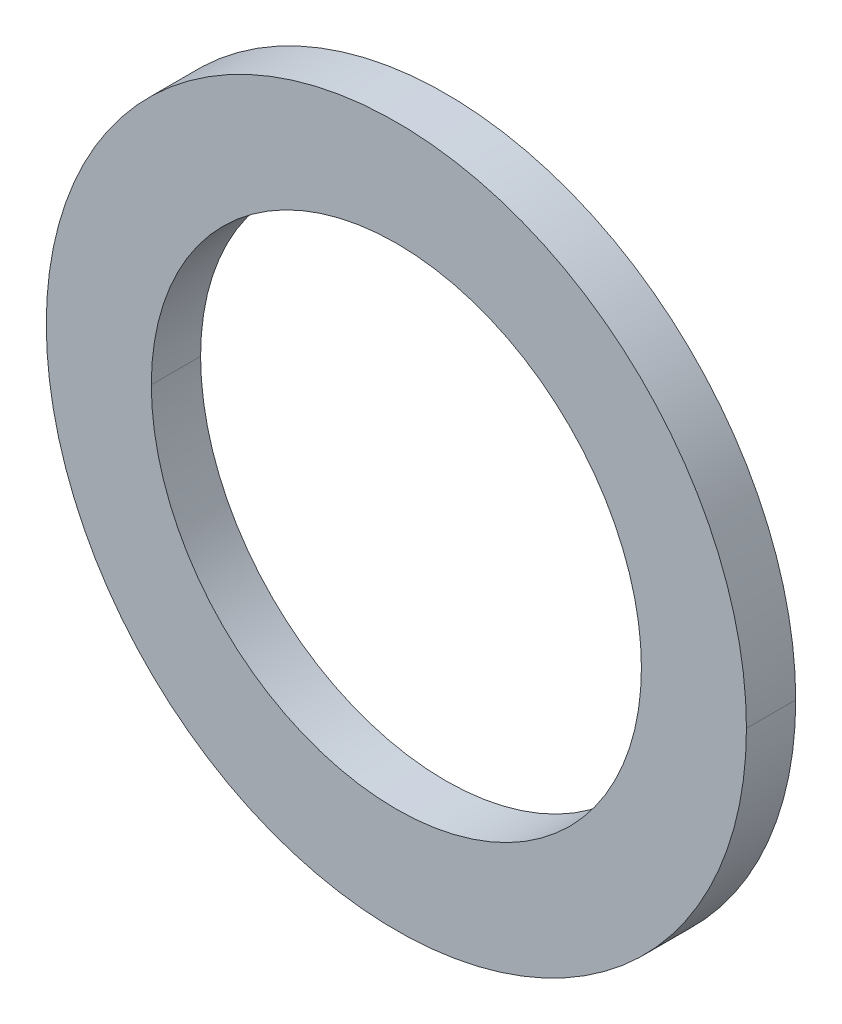
ISO-10303-21;
HEADER;
FILE_DESCRIPTION(('STEP AP214'),'2;1');
FILE_NAME('part.step','',(''),(''),'','','');
FILE_SCHEMA(('AUTOMOTIVE_DESIGN { 1 0 10303 214 1 1 1 1 }'));
ENDSEC;
DATA;
#1=APPLICATION_CONTEXT('core data for automotive mechanical design processes');
#2=APPLICATION_PROTOCOL_DEFINITION('international standard','automotive_design',2000,#1);
#3=PRODUCT_CONTEXT('',#1,'mechanical');
#4=PRODUCT('Part','Part','',(#3));
#5=PRODUCT_RELATED_PRODUCT_CATEGORY('part','',(#4));
#6=PRODUCT_DEFINITION_FORMATION('','',#4);
#7=PRODUCT_DEFINITION_CONTEXT('part definition',#1,'design');
#8=PRODUCT_DEFINITION('design','',#6,#7);
#9=PRODUCT_DEFINITION_SHAPE('','',#8);
#10=(LENGTH_UNIT() NAMED_UNIT(*) SI_UNIT(.MILLI.,.METRE.));
#11=(NAMED_UNIT(*) PLANE_ANGLE_UNIT() SI_UNIT($,.RADIAN.));
#12=(NAMED_UNIT(*) SI_UNIT($,.STERADIAN.) SOLID_ANGLE_UNIT());
#13=UNCERTAINTY_MEASURE_WITH_UNIT(LENGTH_MEASURE(1.E-05),#10,'distance_accuracy_value','');
#14=(GEOMETRIC_REPRESENTATION_CONTEXT(3) GLOBAL_UNCERTAINTY_ASSIGNED_CONTEXT((#13)) GLOBAL_UNIT_ASSIGNED_CONTEXT((#10,
#11,#12)) REPRESENTATION_CONTEXT('',''));
#15=CARTESIAN_POINT('',(0.,0.,0.));
#16=DIRECTION('',(0.,0.,1.));
#17=DIRECTION('',(1.,0.,0.));
#18=AXIS2_PLACEMENT_3D('',#15,#16,#17);
#19=CARTESIAN_POINT('',(0.,0.,0.5588));
#20=DIRECTION('',(0.,0.,-1.));
#21=DIRECTION('',(-1.,0.,0.));
#22=AXIS2_PLACEMENT_3D('',#19,#20,#21);
#23=CYLINDRICAL_SURFACE('',#22,5.55625);
#24=CARTESIAN_POINT('',(0.,0.,0.5588));
#25=DIRECTION('',(0.,0.,1.));
#26=DIRECTION('',(1.,0.,0.));
#27=AXIS2_PLACEMENT_3D('',#24,#25,#26);
#28=CIRCLE('',#27,5.55625);
#29=CARTESIAN_POINT('',(-5.55625,0.,0.5588));
#30=VERTEX_POINT('',#29);
#31=CARTESIAN_POINT('',(5.55625,0.,0.5588));
#32=VERTEX_POINT('',#31);
#33=EDGE_CURVE('E11',#30,#32,#28,.T.);
#34=ORIENTED_EDGE('',*,*,#33,.T.);
#35=DIRECTION('',(0.,0.,-1.));
#36=VECTOR('',#35,1.);
#37=CARTESIAN_POINT('',(5.55625,0.,0.5588));
#38=LINE('',#37,#36);
#39=CARTESIAN_POINT('',(5.55625,0.,-0.5588));
#40=VERTEX_POINT('',#39);
#41=EDGE_CURVE('E20',#32,#40,#38,.T.);
#42=ORIENTED_EDGE('',*,*,#41,.T.);
#43=CARTESIAN_POINT('',(0.,0.,-0.5588));
#44=DIRECTION('',(0.,0.,1.));
#45=DIRECTION('',(1.,0.,0.));
#46=AXIS2_PLACEMENT_3D('',#43,#44,#45);
#47=CIRCLE('',#46,5.55625);
#48=CARTESIAN_POINT('',(-5.55625,0.,-0.5588));
#49=VERTEX_POINT('',#48);
#50=EDGE_CURVE('E106',#49,#40,#47,.T.);
#51=ORIENTED_EDGE('',*,*,#50,.F.);
#52=DIRECTION('',(0.,0.,-1.));
#53=VECTOR('',#52,1.);
#54=CARTESIAN_POINT('',(-5.55625,0.,0.5588));
#55=LINE('',#54,#53);
#56=EDGE_CURVE('E100',#30,#49,#55,.T.);
#57=ORIENTED_EDGE('',*,*,#56,.F.);
#58=EDGE_LOOP('',(#34,#42,#51,#57));
#59=FACE_BOUND('',#58,.T.);
#60=ADVANCED_FACE('F16',(#59),#23,.F.);
#61=CARTESIAN_POINT('',(0.,0.,0.5588));
#62=DIRECTION('',(0.,0.,-1.));
#63=DIRECTION('',(-1.,0.,0.));
#64=AXIS2_PLACEMENT_3D('',#61,#62,#63);
#65=CYLINDRICAL_SURFACE('',#64,7.9375);
#66=CARTESIAN_POINT('',(0.,0.,0.5588));
#67=DIRECTION('',(0.,0.,1.));
#68=DIRECTION('',(1.,0.,0.));
#69=AXIS2_PLACEMENT_3D('',#66,#67,#68);
#70=CIRCLE('',#69,7.9375);
#71=CARTESIAN_POINT('',(7.9375,0.,0.5588));
#72=VERTEX_POINT('',#71);
#73=CARTESIAN_POINT('',(-7.9375,0.,0.5588));
#74=VERTEX_POINT('',#73);
#75=EDGE_CURVE('E85',#72,#74,#70,.T.);
#76=ORIENTED_EDGE('',*,*,#75,.F.);
#77=DIRECTION('',(0.,0.,-1.));
#78=VECTOR('',#77,1.);
#79=CARTESIAN_POINT('',(7.9375,0.,0.5588));
#80=LINE('',#79,#78);
#81=CARTESIAN_POINT('',(7.9375,0.,-0.5588));
#82=VERTEX_POINT('',#81);
#83=EDGE_CURVE('E80',#72,#82,#80,.T.);
#84=ORIENTED_EDGE('',*,*,#83,.T.);
#85=CARTESIAN_POINT('',(0.,0.,-0.5588));
#86=DIRECTION('',(0.,0.,1.));
#87=DIRECTION('',(1.,0.,0.));
#88=AXIS2_PLACEMENT_3D('',#85,#86,#87);
#89=CIRCLE('',#88,7.9375);
#90=CARTESIAN_POINT('',(-7.9375,0.,-0.5588));
#91=VERTEX_POINT('',#90);
#92=EDGE_CURVE('E73',#82,#91,#89,.T.);
#93=ORIENTED_EDGE('',*,*,#92,.T.);
#94=DIRECTION('',(0.,0.,-1.));
#95=VECTOR('',#94,1.);
#96=CARTESIAN_POINT('',(-7.9375,0.,0.5588));
#97=LINE('',#96,#95);
#98=EDGE_CURVE('E65',#74,#91,#97,.T.);
#99=ORIENTED_EDGE('',*,*,#98,.F.);
#100=EDGE_LOOP('',(#76,#84,#93,#99));
#101=FACE_BOUND('',#100,.T.);
#102=ADVANCED_FACE('F18',(#101),#65,.T.);
#103=CARTESIAN_POINT('',(0.,0.,0.5588));
#104=DIRECTION('',(0.,0.,1.));
#105=DIRECTION('',(1.,0.,0.));
#106=AXIS2_PLACEMENT_3D('',#103,#104,#105);
#107=PLANE('',#106);
#108=CARTESIAN_POINT('',(0.,0.,0.5588));
#109=DIRECTION('',(0.,0.,1.));
#110=DIRECTION('',(1.,0.,0.));
#111=AXIS2_PLACEMENT_3D('',#108,#109,#110);
#112=CIRCLE('',#111,7.9375);
#113=EDGE_CURVE('E81',#74,#72,#112,.T.);
#114=ORIENTED_EDGE('',*,*,#113,.T.);
#115=ORIENTED_EDGE('',*,*,#75,.T.);
#116=EDGE_LOOP('',(#114,#115));
#117=FACE_BOUND('',#116,.T.);
#118=ORIENTED_EDGE('',*,*,#33,.F.);
#119=CARTESIAN_POINT('',(0.,0.,0.5588));
#120=DIRECTION('',(0.,0.,1.));
#121=DIRECTION('',(1.,0.,0.));
#122=AXIS2_PLACEMENT_3D('',#119,#120,#121);
#123=CIRCLE('',#122,5.55625);
#124=EDGE_CURVE('E91',#32,#30,#123,.T.);
#125=ORIENTED_EDGE('',*,*,#124,.F.);
#126=EDGE_LOOP('',(#118,#125));
#127=FACE_BOUND('',#126,.T.);
#128=ADVANCED_FACE('F174',(#117,#127),#107,.T.);
#129=CARTESIAN_POINT('',(0.,0.,-0.5588));
#130=DIRECTION('',(0.,0.,1.));
#131=DIRECTION('',(1.,0.,0.));
#132=AXIS2_PLACEMENT_3D('',#129,#130,#131);
#133=PLANE('',#132);
#134=CARTESIAN_POINT('',(0.,0.,-0.5588));
#135=DIRECTION('',(0.,0.,1.));
#136=DIRECTION('',(1.,0.,0.));
#137=AXIS2_PLACEMENT_3D('',#134,#135,#136);
#138=CIRCLE('',#137,7.9375);
#139=EDGE_CURVE('E77',#91,#82,#138,.T.);
#140=ORIENTED_EDGE('',*,*,#139,.F.);
#141=ORIENTED_EDGE('',*,*,#92,.F.);
#142=EDGE_LOOP('',(#140,#141));
#143=FACE_BOUND('',#142,.T.);
#144=ORIENTED_EDGE('',*,*,#50,.T.);
#145=CARTESIAN_POINT('',(0.,0.,-0.5588));
#146=DIRECTION('',(0.,0.,1.));
#147=DIRECTION('',(1.,0.,0.));
#148=AXIS2_PLACEMENT_3D('',#145,#146,#147);
#149=CIRCLE('',#148,5.55625);
#150=EDGE_CURVE('E97',#40,#49,#149,.T.);
#151=ORIENTED_EDGE('',*,*,#150,.T.);
#152=EDGE_LOOP('',(#144,#151));
#153=FACE_BOUND('',#152,.T.);
#154=ADVANCED_FACE('F75',(#143,#153),#133,.F.);
#155=CARTESIAN_POINT('',(0.,0.,0.5588));
#156=DIRECTION('',(0.,0.,-1.));
#157=DIRECTION('',(-1.,0.,0.));
#158=AXIS2_PLACEMENT_3D('',#155,#156,#157);
#159=CYLINDRICAL_SURFACE('',#158,7.9375);
#160=ORIENTED_EDGE('',*,*,#83,.F.);
#161=ORIENTED_EDGE('',*,*,#113,.F.);
#162=ORIENTED_EDGE('',*,*,#98,.T.);
#163=ORIENTED_EDGE('',*,*,#139,.T.);
#164=EDGE_LOOP('',(#160,#161,#162,#163));
#165=FACE_BOUND('',#164,.T.);
#166=ADVANCED_FACE('F89',(#165),#159,.T.);
#167=CARTESIAN_POINT('',(0.,0.,0.5588));
#168=DIRECTION('',(0.,0.,-1.));
#169=DIRECTION('',(-1.,0.,0.));
#170=AXIS2_PLACEMENT_3D('',#167,#168,#169);
#171=CYLINDRICAL_SURFACE('',#170,5.55625);
#172=ORIENTED_EDGE('',*,*,#41,.F.);
#173=ORIENTED_EDGE('',*,*,#124,.T.);
#174=ORIENTED_EDGE('',*,*,#56,.T.);
#175=ORIENTED_EDGE('',*,*,#150,.F.);
#176=EDGE_LOOP('',(#172,#173,#174,#175));
#177=FACE_BOUND('',#176,.T.);
#178=ADVANCED_FACE('F114',(#177),#171,.F.);
#179=CLOSED_SHELL('',(#60,#102,#128,#154,#166,#178));
#180=MANIFOLD_SOLID_BREP('B1',#179);
#181=ADVANCED_BREP_SHAPE_REPRESENTATION('',(#18,#180),#14);
#182=SHAPE_DEFINITION_REPRESENTATION(#9,#181);
ENDSEC;
END-ISO-10303-21;
